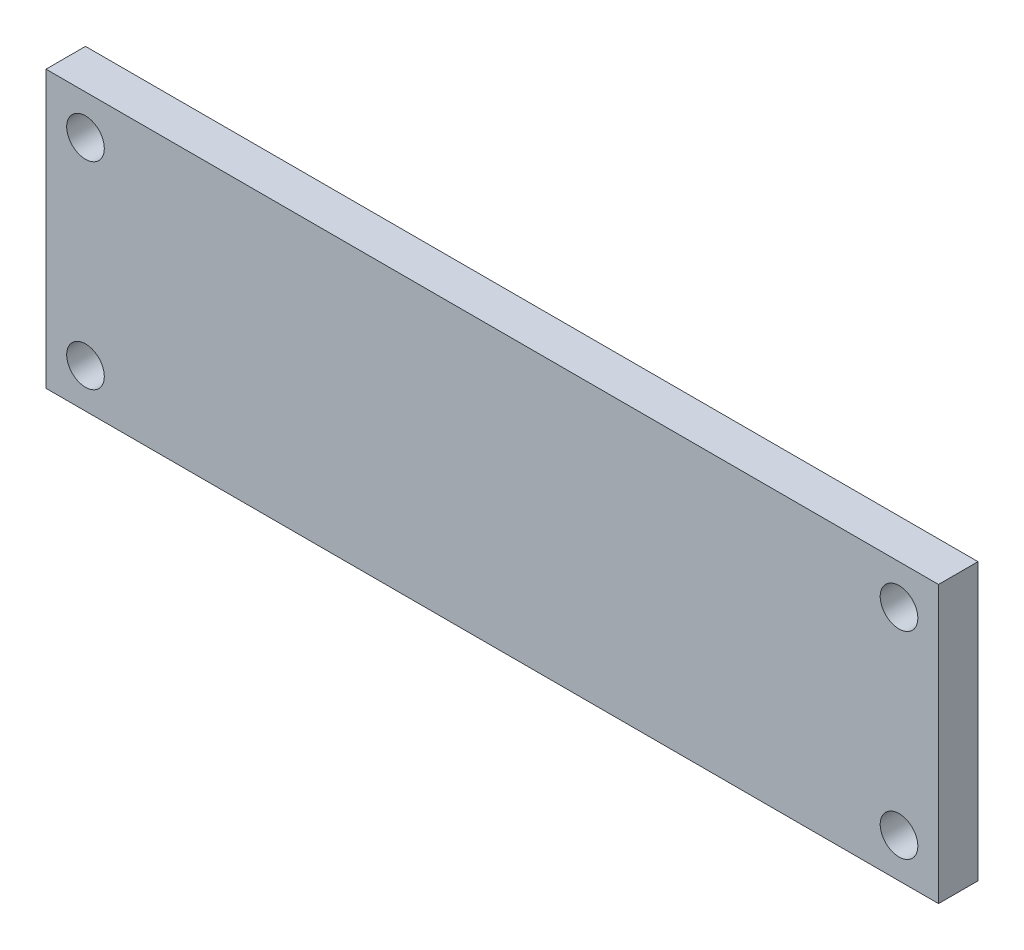
ISO-10303-21;
HEADER;
FILE_DESCRIPTION(('STEP AP214'),'2;1');
FILE_NAME('part.step','',(''),(''),'','','');
FILE_SCHEMA(('AUTOMOTIVE_DESIGN { 1 0 10303 214 1 1 1 1 }'));
ENDSEC;
DATA;
#1=APPLICATION_CONTEXT('core data for automotive mechanical design processes');
#2=APPLICATION_PROTOCOL_DEFINITION('international standard','automotive_design',2000,#1);
#3=PRODUCT_CONTEXT('',#1,'mechanical');
#4=PRODUCT('Part','Part','',(#3));
#5=PRODUCT_RELATED_PRODUCT_CATEGORY('part','',(#4));
#6=PRODUCT_DEFINITION_FORMATION('','',#4);
#7=PRODUCT_DEFINITION_CONTEXT('part definition',#1,'design');
#8=PRODUCT_DEFINITION('design','',#6,#7);
#9=PRODUCT_DEFINITION_SHAPE('','',#8);
#10=(LENGTH_UNIT() NAMED_UNIT(*) SI_UNIT(.MILLI.,.METRE.));
#11=(NAMED_UNIT(*) PLANE_ANGLE_UNIT() SI_UNIT($,.RADIAN.));
#12=(NAMED_UNIT(*) SI_UNIT($,.STERADIAN.) SOLID_ANGLE_UNIT());
#13=UNCERTAINTY_MEASURE_WITH_UNIT(LENGTH_MEASURE(1.E-05),#10,'distance_accuracy_value','');
#14=(GEOMETRIC_REPRESENTATION_CONTEXT(3) GLOBAL_UNCERTAINTY_ASSIGNED_CONTEXT((#13)) GLOBAL_UNIT_ASSIGNED_CONTEXT((#10,
#11,#12)) REPRESENTATION_CONTEXT('',''));
#15=CARTESIAN_POINT('',(0.,0.,0.));
#16=DIRECTION('',(0.,0.,1.));
#17=DIRECTION('',(1.,0.,0.));
#18=AXIS2_PLACEMENT_3D('',#15,#16,#17);
#19=CARTESIAN_POINT('',(0.,0.,5.));
#20=DIRECTION('',(0.,0.,-1.));
#21=DIRECTION('',(-1.,0.,0.));
#22=AXIS2_PLACEMENT_3D('',#19,#20,#21);
#23=PLANE('',#22);
#24=DIRECTION('',(0.,-1.,0.));
#25=VECTOR('',#24,1.);
#26=CARTESIAN_POINT('',(0.,0.,5.));
#27=LINE('',#26,#25);
#28=CARTESIAN_POINT('',(0.,35.,5.));
#29=VERTEX_POINT('',#28);
#30=CARTESIAN_POINT('',(0.,0.,5.));
#31=VERTEX_POINT('',#30);
#32=EDGE_CURVE('E92',#29,#31,#27,.T.);
#33=ORIENTED_EDGE('',*,*,#32,.T.);
#34=DIRECTION('',(1.,0.,0.));
#35=VECTOR('',#34,1.);
#36=CARTESIAN_POINT('',(0.,0.,5.));
#37=LINE('',#36,#35);
#38=CARTESIAN_POINT('',(113.,0.,5.));
#39=VERTEX_POINT('',#38);
#40=EDGE_CURVE('E87',#31,#39,#37,.T.);
#41=ORIENTED_EDGE('',*,*,#40,.T.);
#42=DIRECTION('',(0.,1.,0.));
#43=VECTOR('',#42,1.);
#44=CARTESIAN_POINT('',(113.,0.,5.));
#45=LINE('',#44,#43);
#46=CARTESIAN_POINT('',(113.,35.,5.));
#47=VERTEX_POINT('',#46);
#48=EDGE_CURVE('E90',#39,#47,#45,.T.);
#49=ORIENTED_EDGE('',*,*,#48,.T.);
#50=DIRECTION('',(-1.,0.,0.));
#51=VECTOR('',#50,1.);
#52=CARTESIAN_POINT('',(0.,35.,5.));
#53=LINE('',#52,#51);
#54=EDGE_CURVE('E57',#47,#29,#53,.T.);
#55=ORIENTED_EDGE('',*,*,#54,.T.);
#56=EDGE_LOOP('',(#33,#41,#49,#55));
#57=FACE_BOUND('',#56,.T.);
#58=CARTESIAN_POINT('',(5.,5.,5.));
#59=DIRECTION('',(0.,0.,1.));
#60=DIRECTION('',(1.,0.,0.));
#61=AXIS2_PLACEMENT_3D('',#58,#59,#60);
#62=CIRCLE('',#61,2.38125);
#63=CARTESIAN_POINT('',(7.38125,5.,5.));
#64=VERTEX_POINT('',#63);
#65=EDGE_CURVE('E112',#64,#64,#62,.T.);
#66=ORIENTED_EDGE('',*,*,#65,.F.);
#67=EDGE_LOOP('',(#66));
#68=FACE_BOUND('',#67,.T.);
#69=CARTESIAN_POINT('',(5.,30.,5.));
#70=DIRECTION('',(0.,0.,1.));
#71=DIRECTION('',(1.,0.,0.));
#72=AXIS2_PLACEMENT_3D('',#69,#70,#71);
#73=CIRCLE('',#72,2.38125);
#74=CARTESIAN_POINT('',(7.38125,30.,5.));
#75=VERTEX_POINT('',#74);
#76=EDGE_CURVE('E134',#75,#75,#73,.T.);
#77=ORIENTED_EDGE('',*,*,#76,.F.);
#78=EDGE_LOOP('',(#77));
#79=FACE_BOUND('',#78,.T.);
#80=CARTESIAN_POINT('',(108.,30.,5.));
#81=DIRECTION('',(0.,0.,1.));
#82=DIRECTION('',(1.,0.,0.));
#83=AXIS2_PLACEMENT_3D('',#80,#81,#82);
#84=CIRCLE('',#83,2.38125000000001);
#85=CARTESIAN_POINT('',(110.38125,30.,5.));
#86=VERTEX_POINT('',#85);
#87=EDGE_CURVE('E142',#86,#86,#84,.T.);
#88=ORIENTED_EDGE('',*,*,#87,.F.);
#89=EDGE_LOOP('',(#88));
#90=FACE_BOUND('',#89,.T.);
#91=CARTESIAN_POINT('',(108.,5.,5.));
#92=DIRECTION('',(0.,0.,1.));
#93=DIRECTION('',(1.,0.,0.));
#94=AXIS2_PLACEMENT_3D('',#91,#92,#93);
#95=CIRCLE('',#94,2.38125000000001);
#96=CARTESIAN_POINT('',(110.38125,5.,5.));
#97=VERTEX_POINT('',#96);
#98=EDGE_CURVE('E150',#97,#97,#95,.T.);
#99=ORIENTED_EDGE('',*,*,#98,.F.);
#100=EDGE_LOOP('',(#99));
#101=FACE_BOUND('',#100,.T.);
#102=ADVANCED_FACE('F39',(#57,#68,#79,#90,#101),#23,.F.);
#103=CARTESIAN_POINT('',(0.,0.,0.));
#104=DIRECTION('',(0.,0.,-1.));
#105=DIRECTION('',(-1.,0.,0.));
#106=AXIS2_PLACEMENT_3D('',#103,#104,#105);
#107=PLANE('',#106);
#108=CARTESIAN_POINT('',(108.,30.,0.));
#109=DIRECTION('',(0.,0.,1.));
#110=DIRECTION('',(1.,0.,0.));
#111=AXIS2_PLACEMENT_3D('',#108,#109,#110);
#112=CIRCLE('',#111,2.38125000000001);
#113=CARTESIAN_POINT('',(110.38125,30.,0.));
#114=VERTEX_POINT('',#113);
#115=EDGE_CURVE('E146',#114,#114,#112,.T.);
#116=ORIENTED_EDGE('',*,*,#115,.T.);
#117=EDGE_LOOP('',(#116));
#118=FACE_BOUND('',#117,.T.);
#119=CARTESIAN_POINT('',(5.,5.,0.));
#120=DIRECTION('',(0.,0.,1.));
#121=DIRECTION('',(1.,0.,0.));
#122=AXIS2_PLACEMENT_3D('',#119,#120,#121);
#123=CIRCLE('',#122,2.38125);
#124=CARTESIAN_POINT('',(7.38125,5.,0.));
#125=VERTEX_POINT('',#124);
#126=EDGE_CURVE('E130',#125,#125,#123,.T.);
#127=ORIENTED_EDGE('',*,*,#126,.T.);
#128=EDGE_LOOP('',(#127));
#129=FACE_BOUND('',#128,.T.);
#130=DIRECTION('',(0.,-1.,0.));
#131=VECTOR('',#130,1.);
#132=CARTESIAN_POINT('',(0.,0.,0.));
#133=LINE('',#132,#131);
#134=CARTESIAN_POINT('',(0.,35.,0.));
#135=VERTEX_POINT('',#134);
#136=CARTESIAN_POINT('',(0.,0.,0.));
#137=VERTEX_POINT('',#136);
#138=EDGE_CURVE('E108',#135,#137,#133,.T.);
#139=ORIENTED_EDGE('',*,*,#138,.F.);
#140=DIRECTION('',(-1.,0.,0.));
#141=VECTOR('',#140,1.);
#142=CARTESIAN_POINT('',(0.,35.,0.));
#143=LINE('',#142,#141);
#144=CARTESIAN_POINT('',(113.,35.,0.));
#145=VERTEX_POINT('',#144);
#146=EDGE_CURVE('E80',#145,#135,#143,.T.);
#147=ORIENTED_EDGE('',*,*,#146,.F.);
#148=DIRECTION('',(0.,1.,0.));
#149=VECTOR('',#148,1.);
#150=CARTESIAN_POINT('',(113.,0.,0.));
#151=LINE('',#150,#149);
#152=CARTESIAN_POINT('',(113.,0.,0.));
#153=VERTEX_POINT('',#152);
#154=EDGE_CURVE('E74',#153,#145,#151,.T.);
#155=ORIENTED_EDGE('',*,*,#154,.F.);
#156=DIRECTION('',(1.,0.,0.));
#157=VECTOR('',#156,1.);
#158=CARTESIAN_POINT('',(0.,0.,0.));
#159=LINE('',#158,#157);
#160=EDGE_CURVE('E97',#137,#153,#159,.T.);
#161=ORIENTED_EDGE('',*,*,#160,.F.);
#162=EDGE_LOOP('',(#139,#147,#155,#161));
#163=FACE_BOUND('',#162,.T.);
#164=CARTESIAN_POINT('',(5.,30.,0.));
#165=DIRECTION('',(0.,0.,1.));
#166=DIRECTION('',(1.,0.,0.));
#167=AXIS2_PLACEMENT_3D('',#164,#165,#166);
#168=CIRCLE('',#167,2.38125);
#169=CARTESIAN_POINT('',(7.38125,30.,0.));
#170=VERTEX_POINT('',#169);
#171=EDGE_CURVE('E138',#170,#170,#168,.T.);
#172=ORIENTED_EDGE('',*,*,#171,.T.);
#173=EDGE_LOOP('',(#172));
#174=FACE_BOUND('',#173,.T.);
#175=CARTESIAN_POINT('',(108.,5.,0.));
#176=DIRECTION('',(0.,0.,1.));
#177=DIRECTION('',(1.,0.,0.));
#178=AXIS2_PLACEMENT_3D('',#175,#176,#177);
#179=CIRCLE('',#178,2.38125000000001);
#180=CARTESIAN_POINT('',(110.38125,5.,0.));
#181=VERTEX_POINT('',#180);
#182=EDGE_CURVE('E154',#181,#181,#179,.T.);
#183=ORIENTED_EDGE('',*,*,#182,.T.);
#184=EDGE_LOOP('',(#183));
#185=FACE_BOUND('',#184,.T.);
#186=ADVANCED_FACE('F125',(#118,#129,#163,#174,#185),#107,.T.);
#187=CARTESIAN_POINT('',(0.,0.,5.));
#188=DIRECTION('',(1.,0.,0.));
#189=DIRECTION('',(0.,0.,-1.));
#190=AXIS2_PLACEMENT_3D('',#187,#188,#189);
#191=PLANE('',#190);
#192=ORIENTED_EDGE('',*,*,#138,.T.);
#193=DIRECTION('',(0.,0.,-1.));
#194=VECTOR('',#193,1.);
#195=CARTESIAN_POINT('',(0.,0.,5.));
#196=LINE('',#195,#194);
#197=EDGE_CURVE('E11',#31,#137,#196,.T.);
#198=ORIENTED_EDGE('',*,*,#197,.F.);
#199=ORIENTED_EDGE('',*,*,#32,.F.);
#200=DIRECTION('',(0.,0.,-1.));
#201=VECTOR('',#200,1.);
#202=CARTESIAN_POINT('',(0.,35.,5.));
#203=LINE('',#202,#201);
#204=EDGE_CURVE('E104',#29,#135,#203,.T.);
#205=ORIENTED_EDGE('',*,*,#204,.T.);
#206=EDGE_LOOP('',(#192,#198,#199,#205));
#207=FACE_BOUND('',#206,.T.);
#208=ADVANCED_FACE('F41',(#207),#191,.F.);
#209=CARTESIAN_POINT('',(0.,0.,5.));
#210=DIRECTION('',(0.,1.,0.));
#211=DIRECTION('',(0.,0.,1.));
#212=AXIS2_PLACEMENT_3D('',#209,#210,#211);
#213=PLANE('',#212);
#214=ORIENTED_EDGE('',*,*,#160,.T.);
#215=DIRECTION('',(0.,0.,-1.));
#216=VECTOR('',#215,1.);
#217=CARTESIAN_POINT('',(113.,0.,5.));
#218=LINE('',#217,#216);
#219=EDGE_CURVE('E49',#39,#153,#218,.T.);
#220=ORIENTED_EDGE('',*,*,#219,.F.);
#221=ORIENTED_EDGE('',*,*,#40,.F.);
#222=ORIENTED_EDGE('',*,*,#197,.T.);
#223=EDGE_LOOP('',(#214,#220,#221,#222));
#224=FACE_BOUND('',#223,.T.);
#225=ADVANCED_FACE('F96',(#224),#213,.F.);
#226=CARTESIAN_POINT('',(113.,0.,5.));
#227=DIRECTION('',(-1.,0.,0.));
#228=DIRECTION('',(0.,0.,1.));
#229=AXIS2_PLACEMENT_3D('',#226,#227,#228);
#230=PLANE('',#229);
#231=ORIENTED_EDGE('',*,*,#154,.T.);
#232=DIRECTION('',(0.,0.,-1.));
#233=VECTOR('',#232,1.);
#234=CARTESIAN_POINT('',(113.,35.,5.));
#235=LINE('',#234,#233);
#236=EDGE_CURVE('E99',#47,#145,#235,.T.);
#237=ORIENTED_EDGE('',*,*,#236,.F.);
#238=ORIENTED_EDGE('',*,*,#48,.F.);
#239=ORIENTED_EDGE('',*,*,#219,.T.);
#240=EDGE_LOOP('',(#231,#237,#238,#239));
#241=FACE_BOUND('',#240,.T.);
#242=ADVANCED_FACE('F100',(#241),#230,.F.);
#243=CARTESIAN_POINT('',(0.,35.,5.));
#244=DIRECTION('',(0.,-1.,0.));
#245=DIRECTION('',(0.,0.,-1.));
#246=AXIS2_PLACEMENT_3D('',#243,#244,#245);
#247=PLANE('',#246);
#248=ORIENTED_EDGE('',*,*,#146,.T.);
#249=ORIENTED_EDGE('',*,*,#204,.F.);
#250=ORIENTED_EDGE('',*,*,#54,.F.);
#251=ORIENTED_EDGE('',*,*,#236,.T.);
#252=EDGE_LOOP('',(#248,#249,#250,#251));
#253=FACE_BOUND('',#252,.T.);
#254=ADVANCED_FACE('F122',(#253),#247,.F.);
#255=CARTESIAN_POINT('',(5.,5.,5.));
#256=DIRECTION('',(0.,0.,-1.));
#257=DIRECTION('',(-1.,0.,0.));
#258=AXIS2_PLACEMENT_3D('',#255,#256,#257);
#259=CYLINDRICAL_SURFACE('',#258,2.38125);
#260=ORIENTED_EDGE('',*,*,#65,.T.);
#261=EDGE_LOOP('',(#260));
#262=FACE_BOUND('',#261,.T.);
#263=ORIENTED_EDGE('',*,*,#126,.F.);
#264=EDGE_LOOP('',(#263));
#265=FACE_BOUND('',#264,.T.);
#266=ADVANCED_FACE('F173',(#262,#265),#259,.F.);
#267=CARTESIAN_POINT('',(5.,30.,5.));
#268=DIRECTION('',(0.,0.,-1.));
#269=DIRECTION('',(-1.,0.,0.));
#270=AXIS2_PLACEMENT_3D('',#267,#268,#269);
#271=CYLINDRICAL_SURFACE('',#270,2.38125);
#272=ORIENTED_EDGE('',*,*,#76,.T.);
#273=EDGE_LOOP('',(#272));
#274=FACE_BOUND('',#273,.T.);
#275=ORIENTED_EDGE('',*,*,#171,.F.);
#276=EDGE_LOOP('',(#275));
#277=FACE_BOUND('',#276,.T.);
#278=ADVANCED_FACE('F219',(#274,#277),#271,.F.);
#279=CARTESIAN_POINT('',(108.,30.,5.));
#280=DIRECTION('',(0.,0.,-1.));
#281=DIRECTION('',(-1.,0.,0.));
#282=AXIS2_PLACEMENT_3D('',#279,#280,#281);
#283=CYLINDRICAL_SURFACE('',#282,2.38125000000001);
#284=ORIENTED_EDGE('',*,*,#87,.T.);
#285=EDGE_LOOP('',(#284));
#286=FACE_BOUND('',#285,.T.);
#287=ORIENTED_EDGE('',*,*,#115,.F.);
#288=EDGE_LOOP('',(#287));
#289=FACE_BOUND('',#288,.T.);
#290=ADVANCED_FACE('F227',(#286,#289),#283,.F.);
#291=CARTESIAN_POINT('',(108.,5.,5.));
#292=DIRECTION('',(0.,0.,-1.));
#293=DIRECTION('',(-1.,0.,0.));
#294=AXIS2_PLACEMENT_3D('',#291,#292,#293);
#295=CYLINDRICAL_SURFACE('',#294,2.38125000000001);
#296=ORIENTED_EDGE('',*,*,#98,.T.);
#297=EDGE_LOOP('',(#296));
#298=FACE_BOUND('',#297,.T.);
#299=ORIENTED_EDGE('',*,*,#182,.F.);
#300=EDGE_LOOP('',(#299));
#301=FACE_BOUND('',#300,.T.);
#302=ADVANCED_FACE('F162',(#298,#301),#295,.F.);
#303=CLOSED_SHELL('',(#102,#186,#208,#225,#242,#254,#266,#278,#290,#302));
#304=MANIFOLD_SOLID_BREP('B2',#303);
#305=ADVANCED_BREP_SHAPE_REPRESENTATION('',(#18,#304),#14);
#306=SHAPE_DEFINITION_REPRESENTATION(#9,#305);
ENDSEC;
END-ISO-10303-21;
